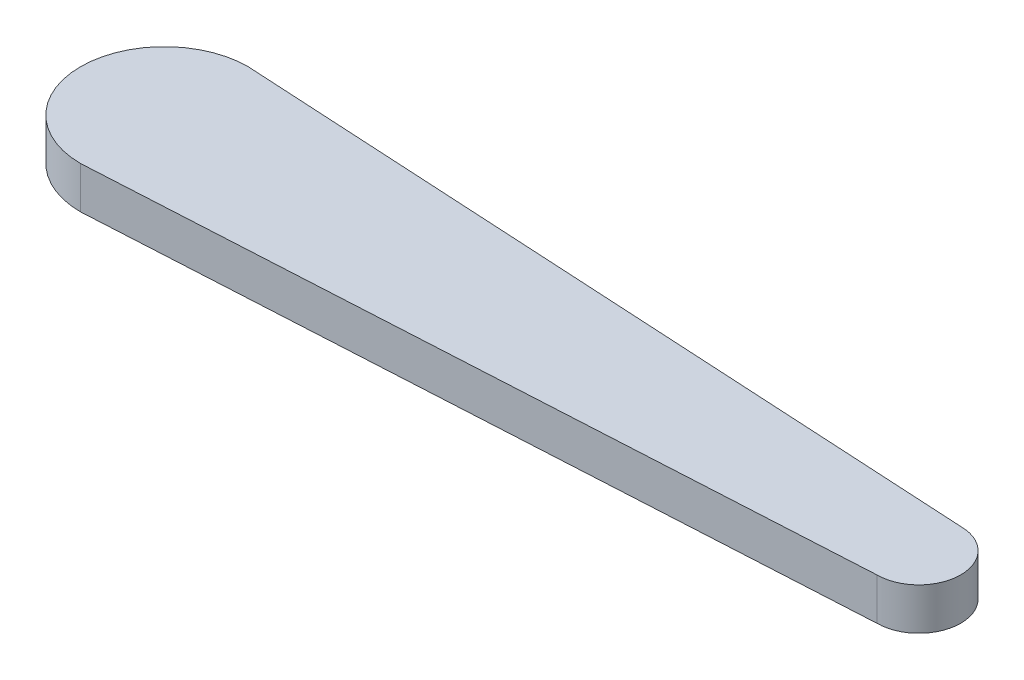
ISO-10303-21;
HEADER;
FILE_DESCRIPTION(('STEP AP214'),'2;1');
FILE_NAME('part.step','',(''),(''),'','','');
FILE_SCHEMA(('AUTOMOTIVE_DESIGN { 1 0 10303 214 1 1 1 1 }'));
ENDSEC;
DATA;
#1=APPLICATION_CONTEXT('core data for automotive mechanical design processes');
#2=APPLICATION_PROTOCOL_DEFINITION('international standard','automotive_design',2000,#1);
#3=PRODUCT_CONTEXT('',#1,'mechanical');
#4=PRODUCT('Part','Part','',(#3));
#5=PRODUCT_RELATED_PRODUCT_CATEGORY('part','',(#4));
#6=PRODUCT_DEFINITION_FORMATION('','',#4);
#7=PRODUCT_DEFINITION_CONTEXT('part definition',#1,'design');
#8=PRODUCT_DEFINITION('design','',#6,#7);
#9=PRODUCT_DEFINITION_SHAPE('','',#8);
#10=(LENGTH_UNIT() NAMED_UNIT(*) SI_UNIT(.MILLI.,.METRE.));
#11=(NAMED_UNIT(*) PLANE_ANGLE_UNIT() SI_UNIT($,.RADIAN.));
#12=(NAMED_UNIT(*) SI_UNIT($,.STERADIAN.) SOLID_ANGLE_UNIT());
#13=UNCERTAINTY_MEASURE_WITH_UNIT(LENGTH_MEASURE(1.E-05),#10,'distance_accuracy_value','');
#14=(GEOMETRIC_REPRESENTATION_CONTEXT(3) GLOBAL_UNCERTAINTY_ASSIGNED_CONTEXT((#13)) GLOBAL_UNIT_ASSIGNED_CONTEXT((#10,
#11,#12)) REPRESENTATION_CONTEXT('',''));
#15=CARTESIAN_POINT('',(0.,0.,0.));
#16=DIRECTION('',(0.,0.,1.));
#17=DIRECTION('',(1.,0.,0.));
#18=AXIS2_PLACEMENT_3D('',#15,#16,#17);
#19=CARTESIAN_POINT('',(0.,5.,0.));
#20=DIRECTION('',(0.,-1.,0.));
#21=DIRECTION('',(0.,0.,-1.));
#22=AXIS2_PLACEMENT_3D('',#19,#20,#21);
#23=CYLINDRICAL_SURFACE('',#22,10.);
#24=CARTESIAN_POINT('',(0.,0.,0.));
#25=DIRECTION('',(0.,1.,0.));
#26=DIRECTION('',(0.,0.,1.));
#27=AXIS2_PLACEMENT_3D('',#24,#25,#26);
#28=CIRCLE('',#27,10.);
#29=CARTESIAN_POINT('',(0.,0.,-10.));
#30=VERTEX_POINT('',#29);
#31=CARTESIAN_POINT('',(0.,0.,10.));
#32=VERTEX_POINT('',#31);
#33=EDGE_CURVE('E107',#30,#32,#28,.T.);
#34=ORIENTED_EDGE('',*,*,#33,.T.);
#35=DIRECTION('',(0.,-1.,0.));
#36=VECTOR('',#35,1.);
#37=CARTESIAN_POINT('',(0.,5.,10.));
#38=LINE('',#37,#36);
#39=CARTESIAN_POINT('',(0.,5.,10.));
#40=VERTEX_POINT('',#39);
#41=EDGE_CURVE('E11',#40,#32,#38,.T.);
#42=ORIENTED_EDGE('',*,*,#41,.F.);
#43=CARTESIAN_POINT('',(0.,5.,0.));
#44=DIRECTION('',(0.,1.,0.));
#45=DIRECTION('',(0.,0.,1.));
#46=AXIS2_PLACEMENT_3D('',#43,#44,#45);
#47=CIRCLE('',#46,10.);
#48=CARTESIAN_POINT('',(0.,5.,-10.));
#49=VERTEX_POINT('',#48);
#50=EDGE_CURVE('E91',#49,#40,#47,.T.);
#51=ORIENTED_EDGE('',*,*,#50,.F.);
#52=DIRECTION('',(0.,-1.,0.));
#53=VECTOR('',#52,1.);
#54=CARTESIAN_POINT('',(0.,5.,-10.));
#55=LINE('',#54,#53);
#56=EDGE_CURVE('E103',#49,#30,#55,.T.);
#57=ORIENTED_EDGE('',*,*,#56,.T.);
#58=EDGE_LOOP('',(#34,#42,#51,#57));
#59=FACE_BOUND('',#58,.T.);
#60=ADVANCED_FACE('F39',(#59),#23,.T.);
#61=CARTESIAN_POINT('',(0.,5.,10.));
#62=DIRECTION('',(-0.055470019622523,0.,-0.998460353205412));
#63=DIRECTION('',(-0.998460353205412,0.,0.055470019622523));
#64=AXIS2_PLACEMENT_3D('',#61,#62,#63);
#65=PLANE('',#64);
#66=DIRECTION('',(0.998460353205412,0.,-0.055470019622523));
#67=VECTOR('',#66,1.);
#68=CARTESIAN_POINT('',(0.,0.,10.));
#69=LINE('',#68,#67);
#70=CARTESIAN_POINT('',(90.,0.,4.99999999999999));
#71=VERTEX_POINT('',#70);
#72=EDGE_CURVE('E96',#32,#71,#69,.T.);
#73=ORIENTED_EDGE('',*,*,#72,.T.);
#74=DIRECTION('',(0.,-1.,0.));
#75=VECTOR('',#74,1.);
#76=CARTESIAN_POINT('',(90.,5.,4.99999999999999));
#77=LINE('',#76,#75);
#78=CARTESIAN_POINT('',(90.,5.,4.99999999999999));
#79=VERTEX_POINT('',#78);
#80=EDGE_CURVE('E48',#79,#71,#77,.T.);
#81=ORIENTED_EDGE('',*,*,#80,.F.);
#82=DIRECTION('',(0.998460353205412,0.,-0.055470019622523));
#83=VECTOR('',#82,1.);
#84=CARTESIAN_POINT('',(0.,5.,10.));
#85=LINE('',#84,#83);
#86=EDGE_CURVE('E86',#40,#79,#85,.T.);
#87=ORIENTED_EDGE('',*,*,#86,.F.);
#88=ORIENTED_EDGE('',*,*,#41,.T.);
#89=EDGE_LOOP('',(#73,#81,#87,#88));
#90=FACE_BOUND('',#89,.T.);
#91=ADVANCED_FACE('F95',(#90),#65,.F.);
#92=CARTESIAN_POINT('',(90.,5.,0.));
#93=DIRECTION('',(0.,-1.,0.));
#94=DIRECTION('',(0.,0.,-1.));
#95=AXIS2_PLACEMENT_3D('',#92,#93,#94);
#96=CYLINDRICAL_SURFACE('',#95,4.99999999999999);
#97=CARTESIAN_POINT('',(90.,0.,0.));
#98=DIRECTION('',(0.,1.,0.));
#99=DIRECTION('',(0.,0.,1.));
#100=AXIS2_PLACEMENT_3D('',#97,#98,#99);
#101=CIRCLE('',#100,4.99999999999999);
#102=CARTESIAN_POINT('',(90.,0.,-4.99999999999999));
#103=VERTEX_POINT('',#102);
#104=EDGE_CURVE('E73',#71,#103,#101,.T.);
#105=ORIENTED_EDGE('',*,*,#104,.T.);
#106=DIRECTION('',(0.,-1.,0.));
#107=VECTOR('',#106,1.);
#108=CARTESIAN_POINT('',(90.,5.,-4.99999999999999));
#109=LINE('',#108,#107);
#110=CARTESIAN_POINT('',(90.,5.,-4.99999999999999));
#111=VERTEX_POINT('',#110);
#112=EDGE_CURVE('E98',#111,#103,#109,.T.);
#113=ORIENTED_EDGE('',*,*,#112,.F.);
#114=CARTESIAN_POINT('',(90.,5.,0.));
#115=DIRECTION('',(0.,1.,0.));
#116=DIRECTION('',(0.,0.,1.));
#117=AXIS2_PLACEMENT_3D('',#114,#115,#116);
#118=CIRCLE('',#117,4.99999999999999);
#119=EDGE_CURVE('E89',#79,#111,#118,.T.);
#120=ORIENTED_EDGE('',*,*,#119,.F.);
#121=ORIENTED_EDGE('',*,*,#80,.T.);
#122=EDGE_LOOP('',(#105,#113,#120,#121));
#123=FACE_BOUND('',#122,.T.);
#124=ADVANCED_FACE('F99',(#123),#96,.T.);
#125=CARTESIAN_POINT('',(0.,5.,-10.));
#126=DIRECTION('',(-0.055470019622523,0.,0.998460353205412));
#127=DIRECTION('',(0.998460353205412,0.,0.055470019622523));
#128=AXIS2_PLACEMENT_3D('',#125,#126,#127);
#129=PLANE('',#128);
#130=DIRECTION('',(-0.998460353205412,0.,-0.055470019622523));
#131=VECTOR('',#130,1.);
#132=CARTESIAN_POINT('',(0.,0.,-10.));
#133=LINE('',#132,#131);
#134=EDGE_CURVE('E79',#103,#30,#133,.T.);
#135=ORIENTED_EDGE('',*,*,#134,.T.);
#136=ORIENTED_EDGE('',*,*,#56,.F.);
#137=DIRECTION('',(-0.998460353205412,0.,-0.055470019622523));
#138=VECTOR('',#137,1.);
#139=CARTESIAN_POINT('',(0.,5.,-10.));
#140=LINE('',#139,#138);
#141=EDGE_CURVE('E56',#111,#49,#140,.T.);
#142=ORIENTED_EDGE('',*,*,#141,.F.);
#143=ORIENTED_EDGE('',*,*,#112,.T.);
#144=EDGE_LOOP('',(#135,#136,#142,#143));
#145=FACE_BOUND('',#144,.T.);
#146=ADVANCED_FACE('F120',(#145),#129,.F.);
#147=CARTESIAN_POINT('',(0.,5.,0.));
#148=DIRECTION('',(0.,1.,0.));
#149=DIRECTION('',(0.,0.,1.));
#150=AXIS2_PLACEMENT_3D('',#147,#148,#149);
#151=PLANE('',#150);
#152=ORIENTED_EDGE('',*,*,#50,.T.);
#153=ORIENTED_EDGE('',*,*,#86,.T.);
#154=ORIENTED_EDGE('',*,*,#119,.T.);
#155=ORIENTED_EDGE('',*,*,#141,.T.);
#156=EDGE_LOOP('',(#152,#153,#154,#155));
#157=FACE_BOUND('',#156,.T.);
#158=ADVANCED_FACE('F87',(#157),#151,.T.);
#159=CARTESIAN_POINT('',(0.,0.,0.));
#160=DIRECTION('',(0.,1.,0.));
#161=DIRECTION('',(0.,0.,1.));
#162=AXIS2_PLACEMENT_3D('',#159,#160,#161);
#163=PLANE('',#162);
#164=ORIENTED_EDGE('',*,*,#33,.F.);
#165=ORIENTED_EDGE('',*,*,#134,.F.);
#166=ORIENTED_EDGE('',*,*,#104,.F.);
#167=ORIENTED_EDGE('',*,*,#72,.F.);
#168=EDGE_LOOP('',(#164,#165,#166,#167));
#169=FACE_BOUND('',#168,.T.);
#170=ADVANCED_FACE('F123',(#169),#163,.F.);
#171=CLOSED_SHELL('',(#60,#91,#124,#146,#158,#170));
#172=MANIFOLD_SOLID_BREP('B2',#171);
#173=ADVANCED_BREP_SHAPE_REPRESENTATION('',(#18,#172),#14);
#174=SHAPE_DEFINITION_REPRESENTATION(#9,#173);
ENDSEC;
END-ISO-10303-21;
